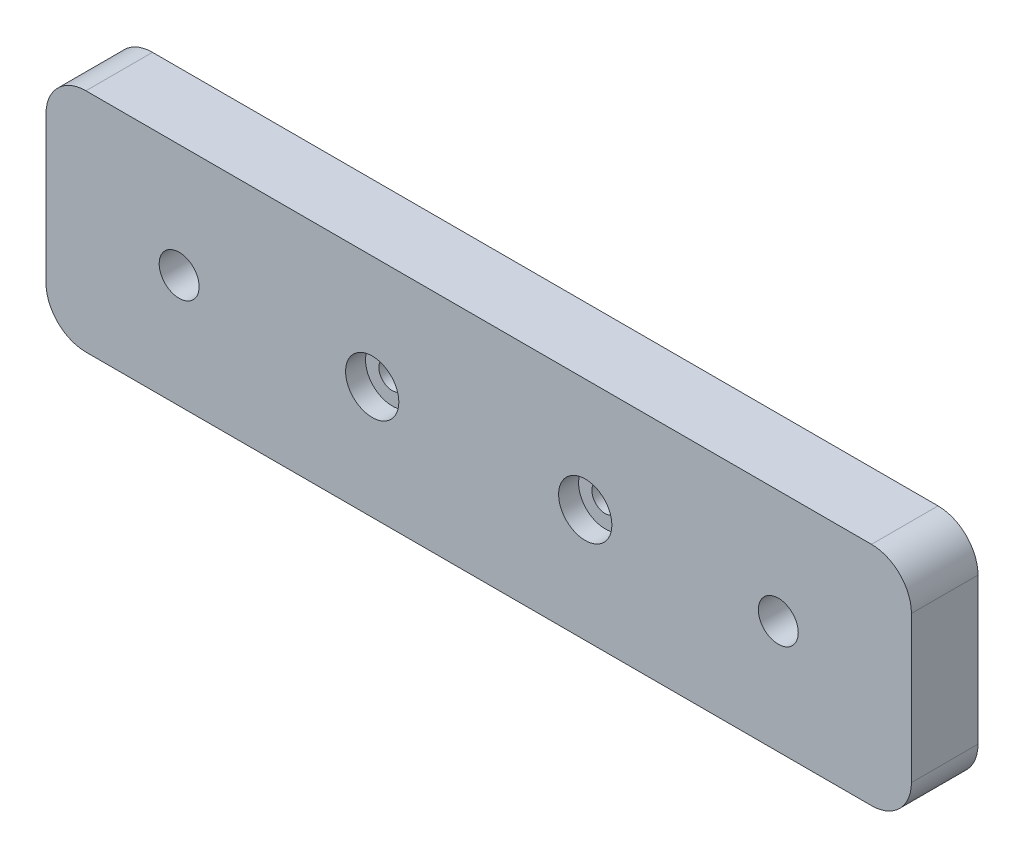
ISO-10303-21;
HEADER;
FILE_DESCRIPTION(('STEP AP214'),'2;1');
FILE_NAME('part.step','',(''),(''),'','','');
FILE_SCHEMA(('AUTOMOTIVE_DESIGN { 1 0 10303 214 1 1 1 1 }'));
ENDSEC;
DATA;
#1=APPLICATION_CONTEXT('core data for automotive mechanical design processes');
#2=APPLICATION_PROTOCOL_DEFINITION('international standard','automotive_design',2000,#1);
#3=PRODUCT_CONTEXT('',#1,'mechanical');
#4=PRODUCT('Part','Part','',(#3));
#5=PRODUCT_RELATED_PRODUCT_CATEGORY('part','',(#4));
#6=PRODUCT_DEFINITION_FORMATION('','',#4);
#7=PRODUCT_DEFINITION_CONTEXT('part definition',#1,'design');
#8=PRODUCT_DEFINITION('design','',#6,#7);
#9=PRODUCT_DEFINITION_SHAPE('','',#8);
#10=(LENGTH_UNIT() NAMED_UNIT(*) SI_UNIT(.MILLI.,.METRE.));
#11=(NAMED_UNIT(*) PLANE_ANGLE_UNIT() SI_UNIT($,.RADIAN.));
#12=(NAMED_UNIT(*) SI_UNIT($,.STERADIAN.) SOLID_ANGLE_UNIT());
#13=UNCERTAINTY_MEASURE_WITH_UNIT(LENGTH_MEASURE(1.E-05),#10,'distance_accuracy_value','');
#14=(GEOMETRIC_REPRESENTATION_CONTEXT(3) GLOBAL_UNCERTAINTY_ASSIGNED_CONTEXT((#13)) GLOBAL_UNIT_ASSIGNED_CONTEXT((#10,
#11,#12)) REPRESENTATION_CONTEXT('',''));
#15=CARTESIAN_POINT('',(0.,0.,0.));
#16=DIRECTION('',(0.,0.,1.));
#17=DIRECTION('',(1.,0.,0.));
#18=AXIS2_PLACEMENT_3D('',#15,#16,#17);
#19=CARTESIAN_POINT('',(10.,8.5,5.));
#20=DIRECTION('',(0.,0.,-1.));
#21=DIRECTION('',(-1.,0.,0.));
#22=AXIS2_PLACEMENT_3D('',#19,#20,#21);
#23=CYLINDRICAL_SURFACE('',#22,1.5);
#24=CARTESIAN_POINT('',(10.,8.5,5.));
#25=DIRECTION('',(0.,0.,1.));
#26=DIRECTION('',(1.,0.,0.));
#27=AXIS2_PLACEMENT_3D('',#24,#25,#26);
#28=CIRCLE('',#27,1.5);
#29=CARTESIAN_POINT('',(11.5,8.5,5.));
#30=VERTEX_POINT('',#29);
#31=EDGE_CURVE('E196',#30,#30,#28,.T.);
#32=ORIENTED_EDGE('',*,*,#31,.T.);
#33=EDGE_LOOP('',(#32));
#34=FACE_BOUND('',#33,.T.);
#35=CARTESIAN_POINT('',(10.,8.5,2.));
#36=DIRECTION('',(0.,0.,-1.));
#37=DIRECTION('',(-1.,0.,0.));
#38=AXIS2_PLACEMENT_3D('',#35,#36,#37);
#39=CIRCLE('',#38,1.5);
#40=CARTESIAN_POINT('',(8.5,8.5,2.));
#41=VERTEX_POINT('',#40);
#42=EDGE_CURVE('E36',#41,#41,#39,.T.);
#43=ORIENTED_EDGE('',*,*,#42,.T.);
#44=EDGE_LOOP('',(#43));
#45=FACE_BOUND('',#44,.T.);
#46=ADVANCED_FACE('F32',(#34,#45),#23,.F.);
#47=CARTESIAN_POINT('',(55.,8.50000000000001,5.));
#48=DIRECTION('',(0.,0.,-1.));
#49=DIRECTION('',(-1.,0.,0.));
#50=AXIS2_PLACEMENT_3D('',#47,#48,#49);
#51=CYLINDRICAL_SURFACE('',#50,1.5);
#52=CARTESIAN_POINT('',(55.,8.50000000000001,5.));
#53=DIRECTION('',(0.,0.,1.));
#54=DIRECTION('',(1.,0.,0.));
#55=AXIS2_PLACEMENT_3D('',#52,#53,#54);
#56=CIRCLE('',#55,1.5);
#57=CARTESIAN_POINT('',(56.5,8.50000000000001,5.));
#58=VERTEX_POINT('',#57);
#59=EDGE_CURVE('E199',#58,#58,#56,.T.);
#60=ORIENTED_EDGE('',*,*,#59,.T.);
#61=EDGE_LOOP('',(#60));
#62=FACE_BOUND('',#61,.T.);
#63=CARTESIAN_POINT('',(55.,8.50000000000001,2.));
#64=DIRECTION('',(0.,0.,-1.));
#65=DIRECTION('',(-1.,0.,0.));
#66=AXIS2_PLACEMENT_3D('',#63,#64,#65);
#67=CIRCLE('',#66,1.5);
#68=CARTESIAN_POINT('',(53.5,8.50000000000001,2.));
#69=VERTEX_POINT('',#68);
#70=EDGE_CURVE('E166',#69,#69,#67,.T.);
#71=ORIENTED_EDGE('',*,*,#70,.T.);
#72=EDGE_LOOP('',(#71));
#73=FACE_BOUND('',#72,.T.);
#74=ADVANCED_FACE('F231',(#62,#73),#51,.F.);
#75=CARTESIAN_POINT('',(40.5,8.5,5.));
#76=DIRECTION('',(0.,0.,-1.));
#77=DIRECTION('',(-1.,0.,0.));
#78=AXIS2_PLACEMENT_3D('',#75,#76,#77);
#79=CYLINDRICAL_SURFACE('',#78,0.999999999999998);
#80=CARTESIAN_POINT('',(40.5,8.5,0.));
#81=DIRECTION('',(0.,0.,1.));
#82=DIRECTION('',(1.,0.,0.));
#83=AXIS2_PLACEMENT_3D('',#80,#81,#82);
#84=CIRCLE('',#83,0.999999999999998);
#85=CARTESIAN_POINT('',(41.5,8.5,0.));
#86=VERTEX_POINT('',#85);
#87=EDGE_CURVE('E160',#86,#86,#84,.T.);
#88=ORIENTED_EDGE('',*,*,#87,.F.);
#89=EDGE_LOOP('',(#88));
#90=FACE_BOUND('',#89,.T.);
#91=CARTESIAN_POINT('',(40.5,8.5,3.5));
#92=DIRECTION('',(0.,0.,1.));
#93=DIRECTION('',(1.,0.,0.));
#94=AXIS2_PLACEMENT_3D('',#91,#92,#93);
#95=CIRCLE('',#94,0.999999999999998);
#96=CARTESIAN_POINT('',(41.5,8.5,3.5));
#97=VERTEX_POINT('',#96);
#98=EDGE_CURVE('E162',#97,#97,#95,.T.);
#99=ORIENTED_EDGE('',*,*,#98,.T.);
#100=EDGE_LOOP('',(#99));
#101=FACE_BOUND('',#100,.T.);
#102=ADVANCED_FACE('F237',(#90,#101),#79,.F.);
#103=CARTESIAN_POINT('',(24.5,8.5,5.));
#104=DIRECTION('',(0.,0.,-1.));
#105=DIRECTION('',(-1.,0.,0.));
#106=AXIS2_PLACEMENT_3D('',#103,#104,#105);
#107=CYLINDRICAL_SURFACE('',#106,1.);
#108=CARTESIAN_POINT('',(24.5,8.5,0.));
#109=DIRECTION('',(0.,0.,1.));
#110=DIRECTION('',(1.,0.,0.));
#111=AXIS2_PLACEMENT_3D('',#108,#109,#110);
#112=CIRCLE('',#111,1.);
#113=CARTESIAN_POINT('',(25.5,8.5,0.));
#114=VERTEX_POINT('',#113);
#115=EDGE_CURVE('E193',#114,#114,#112,.T.);
#116=ORIENTED_EDGE('',*,*,#115,.F.);
#117=EDGE_LOOP('',(#116));
#118=FACE_BOUND('',#117,.T.);
#119=CARTESIAN_POINT('',(24.5,8.5,3.5));
#120=DIRECTION('',(0.,0.,1.));
#121=DIRECTION('',(1.,0.,0.));
#122=AXIS2_PLACEMENT_3D('',#119,#120,#121);
#123=CIRCLE('',#122,1.);
#124=CARTESIAN_POINT('',(25.5,8.5,3.5));
#125=VERTEX_POINT('',#124);
#126=EDGE_CURVE('E157',#125,#125,#123,.T.);
#127=ORIENTED_EDGE('',*,*,#126,.T.);
#128=EDGE_LOOP('',(#127));
#129=FACE_BOUND('',#128,.T.);
#130=ADVANCED_FACE('F242',(#118,#129),#107,.F.);
#131=CARTESIAN_POINT('',(0.,0.,5.));
#132=DIRECTION('',(0.,0.,-1.));
#133=DIRECTION('',(-1.,0.,0.));
#134=AXIS2_PLACEMENT_3D('',#131,#132,#133);
#135=PLANE('',#134);
#136=CARTESIAN_POINT('',(40.5,8.5,5.));
#137=DIRECTION('',(0.,0.,1.));
#138=DIRECTION('',(1.,0.,0.));
#139=AXIS2_PLACEMENT_3D('',#136,#137,#138);
#140=CIRCLE('',#139,2.);
#141=CARTESIAN_POINT('',(42.5,8.5,5.));
#142=VERTEX_POINT('',#141);
#143=EDGE_CURVE('E168',#142,#142,#140,.T.);
#144=ORIENTED_EDGE('',*,*,#143,.F.);
#145=EDGE_LOOP('',(#144));
#146=FACE_BOUND('',#145,.T.);
#147=CARTESIAN_POINT('',(24.5,8.5,5.));
#148=DIRECTION('',(0.,0.,1.));
#149=DIRECTION('',(1.,0.,0.));
#150=AXIS2_PLACEMENT_3D('',#147,#148,#149);
#151=CIRCLE('',#150,2.);
#152=CARTESIAN_POINT('',(26.5,8.5,5.));
#153=VERTEX_POINT('',#152);
#154=EDGE_CURVE('E164',#153,#153,#151,.T.);
#155=ORIENTED_EDGE('',*,*,#154,.F.);
#156=EDGE_LOOP('',(#155));
#157=FACE_BOUND('',#156,.T.);
#158=DIRECTION('',(0.,1.,0.));
#159=VECTOR('',#158,1.);
#160=CARTESIAN_POINT('',(65.,0.,5.));
#161=LINE('',#160,#159);
#162=CARTESIAN_POINT('',(65.,3.,5.));
#163=VERTEX_POINT('',#162);
#164=CARTESIAN_POINT('',(65.,14.,5.));
#165=VERTEX_POINT('',#164);
#166=EDGE_CURVE('E204',#163,#165,#161,.T.);
#167=ORIENTED_EDGE('',*,*,#166,.T.);
#168=CARTESIAN_POINT('',(62.,14.,5.));
#169=DIRECTION('',(0.,0.,-1.));
#170=DIRECTION('',(-1.,0.,0.));
#171=AXIS2_PLACEMENT_3D('',#168,#169,#170);
#172=CIRCLE('',#171,3.);
#173=CARTESIAN_POINT('',(62.,17.,5.));
#174=VERTEX_POINT('',#173);
#175=EDGE_CURVE('E149',#165,#174,#172,.F.);
#176=ORIENTED_EDGE('',*,*,#175,.T.);
#177=DIRECTION('',(-1.,0.,0.));
#178=VECTOR('',#177,1.);
#179=CARTESIAN_POINT('',(0.,17.,5.));
#180=LINE('',#179,#178);
#181=CARTESIAN_POINT('',(3.,17.,5.));
#182=VERTEX_POINT('',#181);
#183=EDGE_CURVE('E120',#174,#182,#180,.T.);
#184=ORIENTED_EDGE('',*,*,#183,.T.);
#185=CARTESIAN_POINT('',(3.,14.,5.));
#186=DIRECTION('',(0.,0.,-1.));
#187=DIRECTION('',(-1.,0.,0.));
#188=AXIS2_PLACEMENT_3D('',#185,#186,#187);
#189=CIRCLE('',#188,3.);
#190=CARTESIAN_POINT('',(0.,14.,5.));
#191=VERTEX_POINT('',#190);
#192=EDGE_CURVE('E144',#182,#191,#189,.F.);
#193=ORIENTED_EDGE('',*,*,#192,.T.);
#194=DIRECTION('',(0.,-1.,0.));
#195=VECTOR('',#194,1.);
#196=CARTESIAN_POINT('',(0.,0.,5.));
#197=LINE('',#196,#195);
#198=CARTESIAN_POINT('',(0.,3.,5.));
#199=VERTEX_POINT('',#198);
#200=EDGE_CURVE('E127',#191,#199,#197,.T.);
#201=ORIENTED_EDGE('',*,*,#200,.T.);
#202=CARTESIAN_POINT('',(3.,3.,5.));
#203=DIRECTION('',(0.,0.,-1.));
#204=DIRECTION('',(-1.,0.,0.));
#205=AXIS2_PLACEMENT_3D('',#202,#203,#204);
#206=CIRCLE('',#205,3.);
#207=CARTESIAN_POINT('',(3.,0.,5.));
#208=VERTEX_POINT('',#207);
#209=EDGE_CURVE('E56',#199,#208,#206,.F.);
#210=ORIENTED_EDGE('',*,*,#209,.T.);
#211=DIRECTION('',(1.,0.,0.));
#212=VECTOR('',#211,1.);
#213=CARTESIAN_POINT('',(0.,0.,5.));
#214=LINE('',#213,#212);
#215=CARTESIAN_POINT('',(62.,0.,5.));
#216=VERTEX_POINT('',#215);
#217=EDGE_CURVE('E130',#208,#216,#214,.T.);
#218=ORIENTED_EDGE('',*,*,#217,.T.);
#219=CARTESIAN_POINT('',(62.,3.,5.));
#220=DIRECTION('',(0.,0.,-1.));
#221=DIRECTION('',(-1.,0.,0.));
#222=AXIS2_PLACEMENT_3D('',#219,#220,#221);
#223=CIRCLE('',#222,3.);
#224=EDGE_CURVE('E147',#216,#163,#223,.F.);
#225=ORIENTED_EDGE('',*,*,#224,.T.);
#226=EDGE_LOOP('',(#167,#176,#184,#193,#201,#210,#218,#225));
#227=FACE_BOUND('',#226,.T.);
#228=ORIENTED_EDGE('',*,*,#59,.F.);
#229=EDGE_LOOP('',(#228));
#230=FACE_BOUND('',#229,.T.);
#231=ORIENTED_EDGE('',*,*,#31,.F.);
#232=EDGE_LOOP('',(#231));
#233=FACE_BOUND('',#232,.T.);
#234=ADVANCED_FACE('F217',(#146,#157,#227,#230,#233),#135,.F.);
#235=CARTESIAN_POINT('',(0.,0.,0.));
#236=DIRECTION('',(0.,0.,-1.));
#237=DIRECTION('',(-1.,0.,0.));
#238=AXIS2_PLACEMENT_3D('',#235,#236,#237);
#239=PLANE('',#238);
#240=CARTESIAN_POINT('',(10.,8.5,0.));
#241=DIRECTION('',(0.,0.,-1.));
#242=DIRECTION('',(-1.,0.,0.));
#243=AXIS2_PLACEMENT_3D('',#240,#241,#242);
#244=CIRCLE('',#243,3.);
#245=CARTESIAN_POINT('',(7.,8.5,0.));
#246=VERTEX_POINT('',#245);
#247=EDGE_CURVE('E182',#246,#246,#244,.T.);
#248=ORIENTED_EDGE('',*,*,#247,.F.);
#249=EDGE_LOOP('',(#248));
#250=FACE_BOUND('',#249,.T.);
#251=CARTESIAN_POINT('',(55.,8.50000000000001,0.));
#252=DIRECTION('',(0.,0.,-1.));
#253=DIRECTION('',(-1.,0.,0.));
#254=AXIS2_PLACEMENT_3D('',#251,#252,#253);
#255=CIRCLE('',#254,3.);
#256=CARTESIAN_POINT('',(52.,8.50000000000001,0.));
#257=VERTEX_POINT('',#256);
#258=EDGE_CURVE('E175',#257,#257,#255,.T.);
#259=ORIENTED_EDGE('',*,*,#258,.F.);
#260=EDGE_LOOP('',(#259));
#261=FACE_BOUND('',#260,.T.);
#262=ORIENTED_EDGE('',*,*,#115,.T.);
#263=EDGE_LOOP('',(#262));
#264=FACE_BOUND('',#263,.T.);
#265=DIRECTION('',(-1.,0.,0.));
#266=VECTOR('',#265,1.);
#267=CARTESIAN_POINT('',(0.,17.,0.));
#268=LINE('',#267,#266);
#269=CARTESIAN_POINT('',(62.,17.,0.));
#270=VERTEX_POINT('',#269);
#271=CARTESIAN_POINT('',(3.,17.,0.));
#272=VERTEX_POINT('',#271);
#273=EDGE_CURVE('E117',#270,#272,#268,.T.);
#274=ORIENTED_EDGE('',*,*,#273,.F.);
#275=CARTESIAN_POINT('',(62.,14.,0.));
#276=DIRECTION('',(0.,0.,-1.));
#277=DIRECTION('',(-1.,0.,0.));
#278=AXIS2_PLACEMENT_3D('',#275,#276,#277);
#279=CIRCLE('',#278,3.);
#280=CARTESIAN_POINT('',(65.,14.,0.));
#281=VERTEX_POINT('',#280);
#282=EDGE_CURVE('E100',#270,#281,#279,.T.);
#283=ORIENTED_EDGE('',*,*,#282,.T.);
#284=DIRECTION('',(0.,1.,0.));
#285=VECTOR('',#284,1.);
#286=CARTESIAN_POINT('',(65.,0.,0.));
#287=LINE('',#286,#285);
#288=CARTESIAN_POINT('',(65.,3.,0.));
#289=VERTEX_POINT('',#288);
#290=EDGE_CURVE('E128',#289,#281,#287,.T.);
#291=ORIENTED_EDGE('',*,*,#290,.F.);
#292=CARTESIAN_POINT('',(62.,3.,0.));
#293=DIRECTION('',(0.,0.,-1.));
#294=DIRECTION('',(-1.,0.,0.));
#295=AXIS2_PLACEMENT_3D('',#292,#293,#294);
#296=CIRCLE('',#295,3.);
#297=CARTESIAN_POINT('',(62.,0.,0.));
#298=VERTEX_POINT('',#297);
#299=EDGE_CURVE('E111',#289,#298,#296,.T.);
#300=ORIENTED_EDGE('',*,*,#299,.T.);
#301=DIRECTION('',(1.,0.,0.));
#302=VECTOR('',#301,1.);
#303=CARTESIAN_POINT('',(0.,0.,0.));
#304=LINE('',#303,#302);
#305=CARTESIAN_POINT('',(3.,0.,0.));
#306=VERTEX_POINT('',#305);
#307=EDGE_CURVE('E132',#306,#298,#304,.T.);
#308=ORIENTED_EDGE('',*,*,#307,.F.);
#309=CARTESIAN_POINT('',(3.,3.,0.));
#310=DIRECTION('',(0.,0.,-1.));
#311=DIRECTION('',(-1.,0.,0.));
#312=AXIS2_PLACEMENT_3D('',#309,#310,#311);
#313=CIRCLE('',#312,3.);
#314=CARTESIAN_POINT('',(0.,3.,0.));
#315=VERTEX_POINT('',#314);
#316=EDGE_CURVE('E138',#306,#315,#313,.T.);
#317=ORIENTED_EDGE('',*,*,#316,.T.);
#318=DIRECTION('',(0.,-1.,0.));
#319=VECTOR('',#318,1.);
#320=CARTESIAN_POINT('',(0.,0.,0.));
#321=LINE('',#320,#319);
#322=CARTESIAN_POINT('',(0.,14.,0.));
#323=VERTEX_POINT('',#322);
#324=EDGE_CURVE('E201',#323,#315,#321,.T.);
#325=ORIENTED_EDGE('',*,*,#324,.F.);
#326=CARTESIAN_POINT('',(3.,14.,0.));
#327=DIRECTION('',(0.,0.,-1.));
#328=DIRECTION('',(-1.,0.,0.));
#329=AXIS2_PLACEMENT_3D('',#326,#327,#328);
#330=CIRCLE('',#329,3.);
#331=EDGE_CURVE('E121',#323,#272,#330,.T.);
#332=ORIENTED_EDGE('',*,*,#331,.T.);
#333=EDGE_LOOP('',(#274,#283,#291,#300,#308,#317,#325,#332));
#334=FACE_BOUND('',#333,.T.);
#335=ORIENTED_EDGE('',*,*,#87,.T.);
#336=EDGE_LOOP('',(#335));
#337=FACE_BOUND('',#336,.T.);
#338=ADVANCED_FACE('F124',(#250,#261,#264,#334,#337),#239,.T.);
#339=CARTESIAN_POINT('',(0.,0.,5.));
#340=DIRECTION('',(1.,0.,0.));
#341=DIRECTION('',(0.,0.,-1.));
#342=AXIS2_PLACEMENT_3D('',#339,#340,#341);
#343=PLANE('',#342);
#344=ORIENTED_EDGE('',*,*,#324,.T.);
#345=DIRECTION('',(0.,0.,-1.));
#346=VECTOR('',#345,1.);
#347=CARTESIAN_POINT('',(0.,3.,5.));
#348=LINE('',#347,#346);
#349=EDGE_CURVE('E11',#315,#199,#348,.F.);
#350=ORIENTED_EDGE('',*,*,#349,.T.);
#351=ORIENTED_EDGE('',*,*,#200,.F.);
#352=DIRECTION('',(0.,0.,-1.));
#353=VECTOR('',#352,1.);
#354=CARTESIAN_POINT('',(0.,14.,5.));
#355=LINE('',#354,#353);
#356=EDGE_CURVE('E41',#191,#323,#355,.T.);
#357=ORIENTED_EDGE('',*,*,#356,.T.);
#358=EDGE_LOOP('',(#344,#350,#351,#357));
#359=FACE_BOUND('',#358,.T.);
#360=ADVANCED_FACE('F228',(#359),#343,.F.);
#361=CARTESIAN_POINT('',(0.,0.,5.));
#362=DIRECTION('',(0.,1.,0.));
#363=DIRECTION('',(0.,0.,1.));
#364=AXIS2_PLACEMENT_3D('',#361,#362,#363);
#365=PLANE('',#364);
#366=ORIENTED_EDGE('',*,*,#307,.T.);
#367=DIRECTION('',(0.,0.,-1.));
#368=VECTOR('',#367,1.);
#369=CARTESIAN_POINT('',(62.,0.,5.));
#370=LINE('',#369,#368);
#371=EDGE_CURVE('E49',#298,#216,#370,.F.);
#372=ORIENTED_EDGE('',*,*,#371,.T.);
#373=ORIENTED_EDGE('',*,*,#217,.F.);
#374=DIRECTION('',(0.,0.,-1.));
#375=VECTOR('',#374,1.);
#376=CARTESIAN_POINT('',(3.,0.,5.));
#377=LINE('',#376,#375);
#378=EDGE_CURVE('E151',#208,#306,#377,.T.);
#379=ORIENTED_EDGE('',*,*,#378,.T.);
#380=EDGE_LOOP('',(#366,#372,#373,#379));
#381=FACE_BOUND('',#380,.T.);
#382=ADVANCED_FACE('F210',(#381),#365,.F.);
#383=CARTESIAN_POINT('',(65.,0.,5.));
#384=DIRECTION('',(-1.,0.,0.));
#385=DIRECTION('',(0.,0.,1.));
#386=AXIS2_PLACEMENT_3D('',#383,#384,#385);
#387=PLANE('',#386);
#388=ORIENTED_EDGE('',*,*,#290,.T.);
#389=DIRECTION('',(0.,0.,-1.));
#390=VECTOR('',#389,1.);
#391=CARTESIAN_POINT('',(65.,14.,5.));
#392=LINE('',#391,#390);
#393=EDGE_CURVE('E105',#281,#165,#392,.F.);
#394=ORIENTED_EDGE('',*,*,#393,.T.);
#395=ORIENTED_EDGE('',*,*,#166,.F.);
#396=DIRECTION('',(0.,0.,-1.));
#397=VECTOR('',#396,1.);
#398=CARTESIAN_POINT('',(65.,3.,5.));
#399=LINE('',#398,#397);
#400=EDGE_CURVE('E110',#163,#289,#399,.T.);
#401=ORIENTED_EDGE('',*,*,#400,.T.);
#402=EDGE_LOOP('',(#388,#394,#395,#401));
#403=FACE_BOUND('',#402,.T.);
#404=ADVANCED_FACE('F220',(#403),#387,.F.);
#405=CARTESIAN_POINT('',(0.,17.,5.));
#406=DIRECTION('',(0.,-1.,0.));
#407=DIRECTION('',(0.,0.,-1.));
#408=AXIS2_PLACEMENT_3D('',#405,#406,#407);
#409=PLANE('',#408);
#410=ORIENTED_EDGE('',*,*,#183,.F.);
#411=DIRECTION('',(0.,0.,-1.));
#412=VECTOR('',#411,1.);
#413=CARTESIAN_POINT('',(62.,17.,5.));
#414=LINE('',#413,#412);
#415=EDGE_CURVE('E104',#174,#270,#414,.T.);
#416=ORIENTED_EDGE('',*,*,#415,.T.);
#417=ORIENTED_EDGE('',*,*,#273,.T.);
#418=DIRECTION('',(0.,0.,-1.));
#419=VECTOR('',#418,1.);
#420=CARTESIAN_POINT('',(3.,17.,5.));
#421=LINE('',#420,#419);
#422=EDGE_CURVE('E122',#272,#182,#421,.F.);
#423=ORIENTED_EDGE('',*,*,#422,.T.);
#424=EDGE_LOOP('',(#410,#416,#417,#423));
#425=FACE_BOUND('',#424,.T.);
#426=ADVANCED_FACE('F116',(#425),#409,.F.);
#427=CARTESIAN_POINT('',(62.,14.,5.));
#428=DIRECTION('',(0.,0.,-1.));
#429=DIRECTION('',(-1.,0.,0.));
#430=AXIS2_PLACEMENT_3D('',#427,#428,#429);
#431=CYLINDRICAL_SURFACE('',#430,3.);
#432=ORIENTED_EDGE('',*,*,#175,.F.);
#433=ORIENTED_EDGE('',*,*,#393,.F.);
#434=ORIENTED_EDGE('',*,*,#282,.F.);
#435=ORIENTED_EDGE('',*,*,#415,.F.);
#436=EDGE_LOOP('',(#432,#433,#434,#435));
#437=FACE_BOUND('',#436,.T.);
#438=ADVANCED_FACE('F103',(#437),#431,.T.);
#439=CARTESIAN_POINT('',(62.,3.,5.));
#440=DIRECTION('',(0.,0.,-1.));
#441=DIRECTION('',(-1.,0.,0.));
#442=AXIS2_PLACEMENT_3D('',#439,#440,#441);
#443=CYLINDRICAL_SURFACE('',#442,3.);
#444=ORIENTED_EDGE('',*,*,#224,.F.);
#445=ORIENTED_EDGE('',*,*,#371,.F.);
#446=ORIENTED_EDGE('',*,*,#299,.F.);
#447=ORIENTED_EDGE('',*,*,#400,.F.);
#448=EDGE_LOOP('',(#444,#445,#446,#447));
#449=FACE_BOUND('',#448,.T.);
#450=ADVANCED_FACE('F214',(#449),#443,.T.);
#451=CARTESIAN_POINT('',(3.,3.,5.));
#452=DIRECTION('',(0.,0.,-1.));
#453=DIRECTION('',(-1.,0.,0.));
#454=AXIS2_PLACEMENT_3D('',#451,#452,#453);
#455=CYLINDRICAL_SURFACE('',#454,3.);
#456=ORIENTED_EDGE('',*,*,#209,.F.);
#457=ORIENTED_EDGE('',*,*,#349,.F.);
#458=ORIENTED_EDGE('',*,*,#316,.F.);
#459=ORIENTED_EDGE('',*,*,#378,.F.);
#460=EDGE_LOOP('',(#456,#457,#458,#459));
#461=FACE_BOUND('',#460,.T.);
#462=ADVANCED_FACE('F282',(#461),#455,.T.);
#463=CARTESIAN_POINT('',(3.,14.,5.));
#464=DIRECTION('',(0.,0.,-1.));
#465=DIRECTION('',(-1.,0.,0.));
#466=AXIS2_PLACEMENT_3D('',#463,#464,#465);
#467=CYLINDRICAL_SURFACE('',#466,3.);
#468=ORIENTED_EDGE('',*,*,#192,.F.);
#469=ORIENTED_EDGE('',*,*,#422,.F.);
#470=ORIENTED_EDGE('',*,*,#331,.F.);
#471=ORIENTED_EDGE('',*,*,#356,.F.);
#472=EDGE_LOOP('',(#468,#469,#470,#471));
#473=FACE_BOUND('',#472,.T.);
#474=ADVANCED_FACE('F34',(#473),#467,.T.);
#475=CARTESIAN_POINT('',(24.5,8.5,3.5));
#476=DIRECTION('',(0.,0.,1.));
#477=DIRECTION('',(1.,0.,0.));
#478=AXIS2_PLACEMENT_3D('',#475,#476,#477);
#479=CYLINDRICAL_SURFACE('',#478,2.);
#480=CARTESIAN_POINT('',(24.5,8.5,3.5));
#481=DIRECTION('',(0.,0.,1.));
#482=DIRECTION('',(1.,0.,0.));
#483=AXIS2_PLACEMENT_3D('',#480,#481,#482);
#484=CIRCLE('',#483,2.);
#485=CARTESIAN_POINT('',(26.5,8.5,3.5));
#486=VERTEX_POINT('',#485);
#487=EDGE_CURVE('E161',#486,#486,#484,.T.);
#488=ORIENTED_EDGE('',*,*,#487,.F.);
#489=EDGE_LOOP('',(#488));
#490=FACE_BOUND('',#489,.T.);
#491=ORIENTED_EDGE('',*,*,#154,.T.);
#492=EDGE_LOOP('',(#491));
#493=FACE_BOUND('',#492,.T.);
#494=ADVANCED_FACE('F270',(#490,#493),#479,.F.);
#495=CARTESIAN_POINT('',(24.5,8.5,3.5));
#496=DIRECTION('',(0.,0.,1.));
#497=DIRECTION('',(1.,0.,0.));
#498=AXIS2_PLACEMENT_3D('',#495,#496,#497);
#499=PLANE('',#498);
#500=ORIENTED_EDGE('',*,*,#126,.F.);
#501=EDGE_LOOP('',(#500));
#502=FACE_BOUND('',#501,.T.);
#503=ORIENTED_EDGE('',*,*,#487,.T.);
#504=EDGE_LOOP('',(#503));
#505=FACE_BOUND('',#504,.T.);
#506=ADVANCED_FACE('F266',(#502,#505),#499,.T.);
#507=CARTESIAN_POINT('',(40.5,8.5,3.5));
#508=DIRECTION('',(0.,0.,1.));
#509=DIRECTION('',(1.,0.,0.));
#510=AXIS2_PLACEMENT_3D('',#507,#508,#509);
#511=CYLINDRICAL_SURFACE('',#510,2.);
#512=CARTESIAN_POINT('',(40.5,8.5,3.5));
#513=DIRECTION('',(0.,0.,1.));
#514=DIRECTION('',(1.,0.,0.));
#515=AXIS2_PLACEMENT_3D('',#512,#513,#514);
#516=CIRCLE('',#515,2.);
#517=CARTESIAN_POINT('',(42.5,8.5,3.5));
#518=VERTEX_POINT('',#517);
#519=EDGE_CURVE('E165',#518,#518,#516,.T.);
#520=ORIENTED_EDGE('',*,*,#519,.F.);
#521=EDGE_LOOP('',(#520));
#522=FACE_BOUND('',#521,.T.);
#523=ORIENTED_EDGE('',*,*,#143,.T.);
#524=EDGE_LOOP('',(#523));
#525=FACE_BOUND('',#524,.T.);
#526=ADVANCED_FACE('F269',(#522,#525),#511,.F.);
#527=CARTESIAN_POINT('',(40.5,8.5,3.5));
#528=DIRECTION('',(0.,0.,1.));
#529=DIRECTION('',(1.,0.,0.));
#530=AXIS2_PLACEMENT_3D('',#527,#528,#529);
#531=PLANE('',#530);
#532=ORIENTED_EDGE('',*,*,#98,.F.);
#533=EDGE_LOOP('',(#532));
#534=FACE_BOUND('',#533,.T.);
#535=ORIENTED_EDGE('',*,*,#519,.T.);
#536=EDGE_LOOP('',(#535));
#537=FACE_BOUND('',#536,.T.);
#538=ADVANCED_FACE('F293',(#534,#537),#531,.T.);
#539=CARTESIAN_POINT('',(55.,8.50000000000001,2.));
#540=DIRECTION('',(0.,0.,-1.));
#541=DIRECTION('',(-1.,0.,0.));
#542=AXIS2_PLACEMENT_3D('',#539,#540,#541);
#543=CYLINDRICAL_SURFACE('',#542,3.);
#544=CARTESIAN_POINT('',(55.,8.50000000000001,2.));
#545=DIRECTION('',(0.,0.,-1.));
#546=DIRECTION('',(-1.,0.,0.));
#547=AXIS2_PLACEMENT_3D('',#544,#545,#546);
#548=CIRCLE('',#547,3.);
#549=CARTESIAN_POINT('',(52.,8.50000000000001,2.));
#550=VERTEX_POINT('',#549);
#551=EDGE_CURVE('E169',#550,#550,#548,.T.);
#552=ORIENTED_EDGE('',*,*,#551,.F.);
#553=EDGE_LOOP('',(#552));
#554=FACE_BOUND('',#553,.T.);
#555=ORIENTED_EDGE('',*,*,#258,.T.);
#556=EDGE_LOOP('',(#555));
#557=FACE_BOUND('',#556,.T.);
#558=ADVANCED_FACE('F296',(#554,#557),#543,.F.);
#559=CARTESIAN_POINT('',(55.,8.50000000000001,2.));
#560=DIRECTION('',(0.,0.,-1.));
#561=DIRECTION('',(-1.,0.,0.));
#562=AXIS2_PLACEMENT_3D('',#559,#560,#561);
#563=PLANE('',#562);
#564=ORIENTED_EDGE('',*,*,#70,.F.);
#565=EDGE_LOOP('',(#564));
#566=FACE_BOUND('',#565,.T.);
#567=ORIENTED_EDGE('',*,*,#551,.T.);
#568=EDGE_LOOP('',(#567));
#569=FACE_BOUND('',#568,.T.);
#570=ADVANCED_FACE('F308',(#566,#569),#563,.T.);
#571=CARTESIAN_POINT('',(10.,8.5,2.));
#572=DIRECTION('',(0.,0.,-1.));
#573=DIRECTION('',(-1.,0.,0.));
#574=AXIS2_PLACEMENT_3D('',#571,#572,#573);
#575=CYLINDRICAL_SURFACE('',#574,3.);
#576=CARTESIAN_POINT('',(10.,8.5,2.));
#577=DIRECTION('',(0.,0.,-1.));
#578=DIRECTION('',(-1.,0.,0.));
#579=AXIS2_PLACEMENT_3D('',#576,#577,#578);
#580=CIRCLE('',#579,3.);
#581=CARTESIAN_POINT('',(7.,8.5,2.));
#582=VERTEX_POINT('',#581);
#583=EDGE_CURVE('E327',#582,#582,#580,.T.);
#584=ORIENTED_EDGE('',*,*,#583,.F.);
#585=EDGE_LOOP('',(#584));
#586=FACE_BOUND('',#585,.T.);
#587=ORIENTED_EDGE('',*,*,#247,.T.);
#588=EDGE_LOOP('',(#587));
#589=FACE_BOUND('',#588,.T.);
#590=ADVANCED_FACE('F312',(#586,#589),#575,.F.);
#591=CARTESIAN_POINT('',(10.,8.5,2.));
#592=DIRECTION('',(0.,0.,-1.));
#593=DIRECTION('',(-1.,0.,0.));
#594=AXIS2_PLACEMENT_3D('',#591,#592,#593);
#595=PLANE('',#594);
#596=ORIENTED_EDGE('',*,*,#42,.F.);
#597=EDGE_LOOP('',(#596));
#598=FACE_BOUND('',#597,.T.);
#599=ORIENTED_EDGE('',*,*,#583,.T.);
#600=EDGE_LOOP('',(#599));
#601=FACE_BOUND('',#600,.T.);
#602=ADVANCED_FACE('F316',(#598,#601),#595,.T.);
#603=CLOSED_SHELL('',(#46,#74,#102,#130,#234,#338,#360,#382,#404,#426,#438,#450,#462,#474,#494,
#506,#526,#538,#558,#570,#590,#602));
#604=MANIFOLD_SOLID_BREP('B2',#603);
#605=ADVANCED_BREP_SHAPE_REPRESENTATION('',(#18,#604),#14);
#606=SHAPE_DEFINITION_REPRESENTATION(#9,#605);
ENDSEC;
END-ISO-10303-21;
